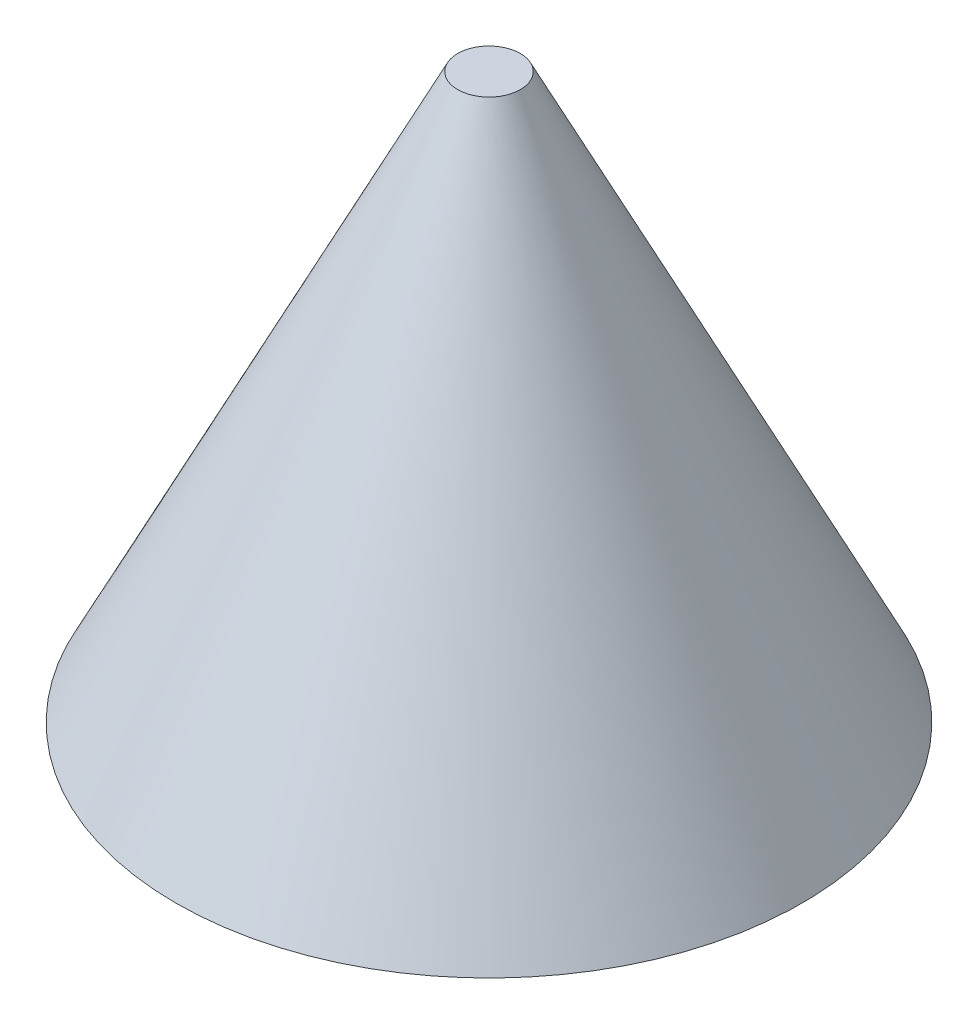
ISO-10303-21;
HEADER;
FILE_DESCRIPTION(('STEP AP214'),'2;1');
FILE_NAME('part.step','',(''),(''),'','','');
FILE_SCHEMA(('AUTOMOTIVE_DESIGN { 1 0 10303 214 1 1 1 1 }'));
ENDSEC;
DATA;
#1=APPLICATION_CONTEXT('core data for automotive mechanical design processes');
#2=APPLICATION_PROTOCOL_DEFINITION('international standard','automotive_design',2000,#1);
#3=PRODUCT_CONTEXT('',#1,'mechanical');
#4=PRODUCT('Part','Part','',(#3));
#5=PRODUCT_RELATED_PRODUCT_CATEGORY('part','',(#4));
#6=PRODUCT_DEFINITION_FORMATION('','',#4);
#7=PRODUCT_DEFINITION_CONTEXT('part definition',#1,'design');
#8=PRODUCT_DEFINITION('design','',#6,#7);
#9=PRODUCT_DEFINITION_SHAPE('','',#8);
#10=(LENGTH_UNIT() NAMED_UNIT(*) SI_UNIT(.MILLI.,.METRE.));
#11=(NAMED_UNIT(*) PLANE_ANGLE_UNIT() SI_UNIT($,.RADIAN.));
#12=(NAMED_UNIT(*) SI_UNIT($,.STERADIAN.) SOLID_ANGLE_UNIT());
#13=UNCERTAINTY_MEASURE_WITH_UNIT(LENGTH_MEASURE(1.E-05),#10,'distance_accuracy_value','');
#14=(GEOMETRIC_REPRESENTATION_CONTEXT(3) GLOBAL_UNCERTAINTY_ASSIGNED_CONTEXT((#13)) GLOBAL_UNIT_ASSIGNED_CONTEXT((#10,
#11,#12)) REPRESENTATION_CONTEXT('',''));
#15=CARTESIAN_POINT('',(0.,0.,0.));
#16=DIRECTION('',(0.,0.,1.));
#17=DIRECTION('',(1.,0.,0.));
#18=AXIS2_PLACEMENT_3D('',#15,#16,#17);
#19=CARTESIAN_POINT('',(0.,0.,0.));
#20=DIRECTION('',(0.,-1.,0.));
#21=DIRECTION('',(0.,0.,-1.));
#22=AXIS2_PLACEMENT_3D('',#19,#20,#21);
#23=CONICAL_SURFACE('',#22,5.,0.463647609000806);
#24=CARTESIAN_POINT('',(0.,9.,0.));
#25=DIRECTION('',(0.,-1.,0.));
#26=DIRECTION('',(0.,0.,-1.));
#27=AXIS2_PLACEMENT_3D('',#24,#25,#26);
#28=CIRCLE('',#27,0.5);
#29=CARTESIAN_POINT('',(0.,9.,-0.5));
#30=VERTEX_POINT('',#29);
#31=EDGE_CURVE('E37',#30,#30,#28,.T.);
#32=ORIENTED_EDGE('',*,*,#31,.T.);
#33=EDGE_LOOP('',(#32));
#34=FACE_BOUND('',#33,.T.);
#35=CARTESIAN_POINT('',(0.,0.,0.));
#36=DIRECTION('',(0.,-1.,0.));
#37=DIRECTION('',(0.,0.,-1.));
#38=AXIS2_PLACEMENT_3D('',#35,#36,#37);
#39=CIRCLE('',#38,5.);
#40=CARTESIAN_POINT('',(0.,0.,-5.));
#41=VERTEX_POINT('',#40);
#42=EDGE_CURVE('E10',#41,#41,#39,.T.);
#43=ORIENTED_EDGE('',*,*,#42,.F.);
#44=EDGE_LOOP('',(#43));
#45=FACE_BOUND('',#44,.T.);
#46=ADVANCED_FACE('F31',(#34,#45),#23,.T.);
#47=CARTESIAN_POINT('',(0.,0.,0.));
#48=DIRECTION('',(0.,-1.,0.));
#49=DIRECTION('',(0.,0.,-1.));
#50=AXIS2_PLACEMENT_3D('',#47,#48,#49);
#51=PLANE('',#50);
#52=CARTESIAN_POINT('',(0.,0.,0.));
#53=DIRECTION('',(0.,-1.,0.));
#54=DIRECTION('',(0.,0.,-1.));
#55=AXIS2_PLACEMENT_3D('',#52,#53,#54);
#56=CIRCLE('',#55,2.5);
#57=CARTESIAN_POINT('',(0.,0.,-2.5));
#58=VERTEX_POINT('',#57);
#59=EDGE_CURVE('E45',#58,#58,#56,.T.);
#60=ORIENTED_EDGE('',*,*,#59,.F.);
#61=EDGE_LOOP('',(#60));
#62=FACE_BOUND('',#61,.T.);
#63=ORIENTED_EDGE('',*,*,#42,.T.);
#64=EDGE_LOOP('',(#63));
#65=FACE_BOUND('',#64,.T.);
#66=ADVANCED_FACE('F53',(#62,#65),#51,.T.);
#67=CARTESIAN_POINT('',(0.,9.,0.));
#68=DIRECTION('',(0.,-1.,0.));
#69=DIRECTION('',(0.,0.,-1.));
#70=AXIS2_PLACEMENT_3D('',#67,#68,#69);
#71=PLANE('',#70);
#72=ORIENTED_EDGE('',*,*,#31,.F.);
#73=EDGE_LOOP('',(#72));
#74=FACE_BOUND('',#73,.T.);
#75=ADVANCED_FACE('F55',(#74),#71,.F.);
#76=CARTESIAN_POINT('',(0.,3.,0.));
#77=DIRECTION('',(0.,-1.,0.));
#78=DIRECTION('',(0.,0.,-1.));
#79=AXIS2_PLACEMENT_3D('',#76,#77,#78);
#80=CYLINDRICAL_SURFACE('',#79,2.5);
#81=CARTESIAN_POINT('',(0.,3.,0.));
#82=DIRECTION('',(0.,-1.,0.));
#83=DIRECTION('',(0.,0.,-1.));
#84=AXIS2_PLACEMENT_3D('',#81,#82,#83);
#85=CIRCLE('',#84,2.5);
#86=CARTESIAN_POINT('',(0.,3.,-2.5));
#87=VERTEX_POINT('',#86);
#88=EDGE_CURVE('E41',#87,#87,#85,.T.);
#89=ORIENTED_EDGE('',*,*,#88,.F.);
#90=EDGE_LOOP('',(#89));
#91=FACE_BOUND('',#90,.T.);
#92=ORIENTED_EDGE('',*,*,#59,.T.);
#93=EDGE_LOOP('',(#92));
#94=FACE_BOUND('',#93,.T.);
#95=ADVANCED_FACE('F51',(#91,#94),#80,.F.);
#96=CARTESIAN_POINT('',(0.,3.,0.));
#97=DIRECTION('',(0.,-1.,0.));
#98=DIRECTION('',(0.,0.,-1.));
#99=AXIS2_PLACEMENT_3D('',#96,#97,#98);
#100=PLANE('',#99);
#101=ORIENTED_EDGE('',*,*,#88,.T.);
#102=EDGE_LOOP('',(#101));
#103=FACE_BOUND('',#102,.T.);
#104=ADVANCED_FACE('F65',(#103),#100,.T.);
#105=CLOSED_SHELL('',(#46,#66,#75,#95,#104));
#106=MANIFOLD_SOLID_BREP('B2',#105);
#107=ADVANCED_BREP_SHAPE_REPRESENTATION('',(#18,#106),#14);
#108=SHAPE_DEFINITION_REPRESENTATION(#9,#107);
ENDSEC;
END-ISO-10303-21;
